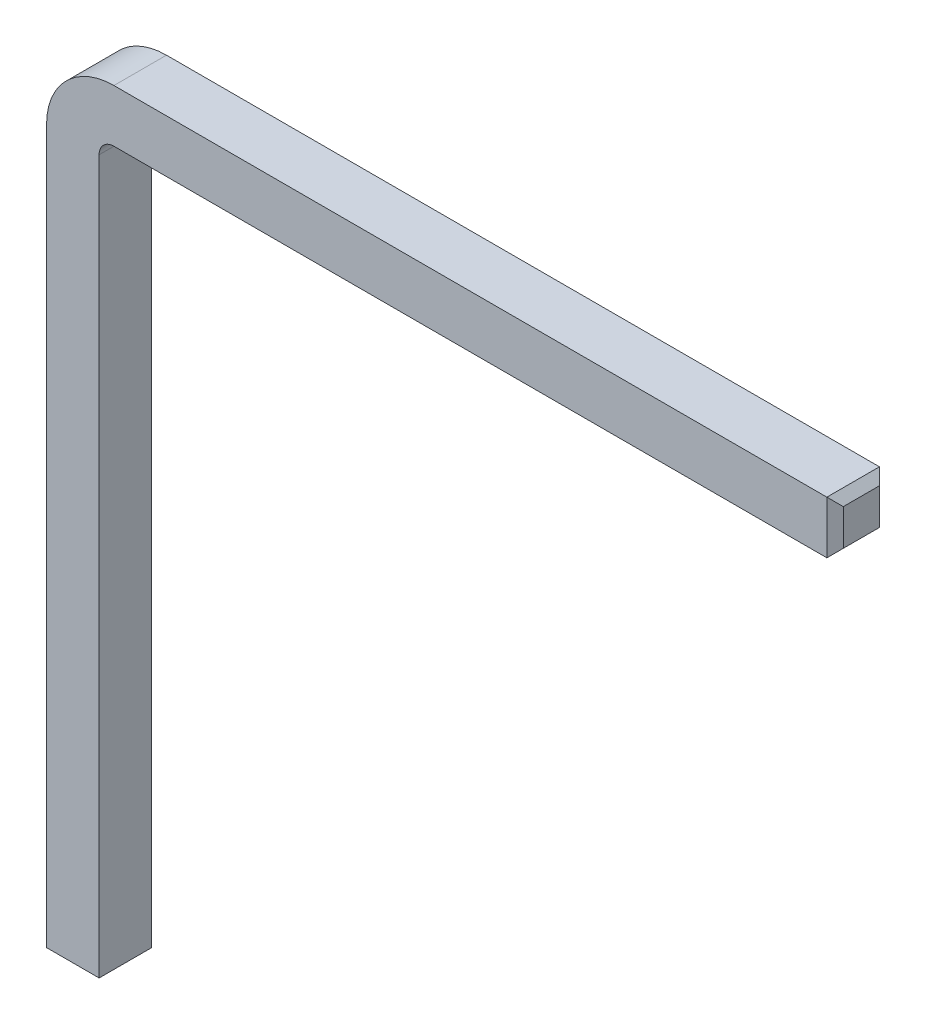
ISO-10303-21;
HEADER;
FILE_DESCRIPTION(('STEP AP214'),'2;1');
FILE_NAME('part.step','',(''),(''),'','','');
FILE_SCHEMA(('AUTOMOTIVE_DESIGN { 1 0 10303 214 1 1 1 1 }'));
ENDSEC;
DATA;
#1=APPLICATION_CONTEXT('core data for automotive mechanical design processes');
#2=APPLICATION_PROTOCOL_DEFINITION('international standard','automotive_design',2000,#1);
#3=PRODUCT_CONTEXT('',#1,'mechanical');
#4=PRODUCT('Part','Part','',(#3));
#5=PRODUCT_RELATED_PRODUCT_CATEGORY('part','',(#4));
#6=PRODUCT_DEFINITION_FORMATION('','',#4);
#7=PRODUCT_DEFINITION_CONTEXT('part definition',#1,'design');
#8=PRODUCT_DEFINITION('design','',#6,#7);
#9=PRODUCT_DEFINITION_SHAPE('','',#8);
#10=(LENGTH_UNIT() NAMED_UNIT(*) SI_UNIT(.MILLI.,.METRE.));
#11=(NAMED_UNIT(*) PLANE_ANGLE_UNIT() SI_UNIT($,.RADIAN.));
#12=(NAMED_UNIT(*) SI_UNIT($,.STERADIAN.) SOLID_ANGLE_UNIT());
#13=UNCERTAINTY_MEASURE_WITH_UNIT(LENGTH_MEASURE(1.E-05),#10,'distance_accuracy_value','');
#14=(GEOMETRIC_REPRESENTATION_CONTEXT(3) GLOBAL_UNCERTAINTY_ASSIGNED_CONTEXT((#13)) GLOBAL_UNIT_ASSIGNED_CONTEXT((#10,
#11,#12)) REPRESENTATION_CONTEXT('',''));
#15=CARTESIAN_POINT('',(0.,0.,0.));
#16=DIRECTION('',(0.,0.,1.));
#17=DIRECTION('',(1.,0.,0.));
#18=AXIS2_PLACEMENT_3D('',#15,#16,#17);
#19=CARTESIAN_POINT('',(0.5,9.6,-0.32));
#20=DIRECTION('',(0.,1.,0.));
#21=DIRECTION('',(0.,0.,1.));
#22=AXIS2_PLACEMENT_3D('',#19,#20,#21);
#23=PLANE('',#22);
#24=DIRECTION('',(1.,0.,0.));
#25=VECTOR('',#24,1.);
#26=CARTESIAN_POINT('',(0.5,9.6,0.32));
#27=LINE('',#26,#25);
#28=CARTESIAN_POINT('',(0.5,9.6,0.32));
#29=VERTEX_POINT('',#28);
#30=CARTESIAN_POINT('',(9.18,9.6,0.32));
#31=VERTEX_POINT('',#30);
#32=EDGE_CURVE('E174',#29,#31,#27,.T.);
#33=ORIENTED_EDGE('',*,*,#32,.T.);
#34=DIRECTION('',(0.,0.,-1.));
#35=VECTOR('',#34,1.);
#36=CARTESIAN_POINT('',(9.18,9.6,-0.32));
#37=LINE('',#36,#35);
#38=CARTESIAN_POINT('',(9.18,9.6,-0.32));
#39=VERTEX_POINT('',#38);
#40=EDGE_CURVE('E11',#31,#39,#37,.T.);
#41=ORIENTED_EDGE('',*,*,#40,.T.);
#42=DIRECTION('',(1.,0.,0.));
#43=VECTOR('',#42,1.);
#44=CARTESIAN_POINT('',(0.5,9.6,-0.32));
#45=LINE('',#44,#43);
#46=CARTESIAN_POINT('',(0.5,9.6,-0.32));
#47=VERTEX_POINT('',#46);
#48=EDGE_CURVE('E177',#47,#39,#45,.T.);
#49=ORIENTED_EDGE('',*,*,#48,.F.);
#50=DIRECTION('',(0.,0.,1.));
#51=VECTOR('',#50,1.);
#52=CARTESIAN_POINT('',(0.5,9.6,-0.32));
#53=LINE('',#52,#51);
#54=EDGE_CURVE('E157',#47,#29,#53,.T.);
#55=ORIENTED_EDGE('',*,*,#54,.T.);
#56=EDGE_LOOP('',(#33,#41,#49,#55));
#57=FACE_BOUND('',#56,.T.);
#58=ADVANCED_FACE('F33',(#57),#23,.T.);
#59=CARTESIAN_POINT('',(0.5,8.96,-0.32));
#60=DIRECTION('',(0.,-1.,0.));
#61=DIRECTION('',(0.,0.,-1.));
#62=AXIS2_PLACEMENT_3D('',#59,#60,#61);
#63=PLANE('',#62);
#64=DIRECTION('',(1.,0.,0.));
#65=VECTOR('',#64,1.);
#66=CARTESIAN_POINT('',(0.5,8.96,-0.32));
#67=LINE('',#66,#65);
#68=CARTESIAN_POINT('',(0.5,8.96,-0.32));
#69=VERTEX_POINT('',#68);
#70=CARTESIAN_POINT('',(9.18,8.96,-0.32));
#71=VERTEX_POINT('',#70);
#72=EDGE_CURVE('E133',#69,#71,#67,.T.);
#73=ORIENTED_EDGE('',*,*,#72,.T.);
#74=DIRECTION('',(0.,0.,1.));
#75=VECTOR('',#74,1.);
#76=CARTESIAN_POINT('',(9.18,8.96,-0.32));
#77=LINE('',#76,#75);
#78=CARTESIAN_POINT('',(9.18,8.96,0.32));
#79=VERTEX_POINT('',#78);
#80=EDGE_CURVE('E42',#71,#79,#77,.T.);
#81=ORIENTED_EDGE('',*,*,#80,.T.);
#82=DIRECTION('',(1.,0.,0.));
#83=VECTOR('',#82,1.);
#84=CARTESIAN_POINT('',(0.5,8.96,0.32));
#85=LINE('',#84,#83);
#86=CARTESIAN_POINT('',(0.5,8.96,0.32));
#87=VERTEX_POINT('',#86);
#88=EDGE_CURVE('E137',#87,#79,#85,.T.);
#89=ORIENTED_EDGE('',*,*,#88,.F.);
#90=DIRECTION('',(0.,0.,-1.));
#91=VECTOR('',#90,1.);
#92=CARTESIAN_POINT('',(0.5,8.96,-0.32));
#93=LINE('',#92,#91);
#94=EDGE_CURVE('E154',#87,#69,#93,.T.);
#95=ORIENTED_EDGE('',*,*,#94,.T.);
#96=EDGE_LOOP('',(#73,#81,#89,#95));
#97=FACE_BOUND('',#96,.T.);
#98=ADVANCED_FACE('F248',(#97),#63,.T.);
#99=CARTESIAN_POINT('',(0.5,8.78,0.));
#100=DIRECTION('',(0.,0.,-1.));
#101=DIRECTION('',(-1.,0.,0.));
#102=AXIS2_PLACEMENT_3D('',#99,#100,#101);
#103=CYLINDRICAL_SURFACE('',#102,0.819999999999999);
#104=DIRECTION('',(0.,0.,1.));
#105=VECTOR('',#104,1.);
#106=CARTESIAN_POINT('',(-0.319999999999999,8.78,-0.32));
#107=LINE('',#106,#105);
#108=CARTESIAN_POINT('',(-0.319999999999999,8.78,-0.32));
#109=VERTEX_POINT('',#108);
#110=CARTESIAN_POINT('',(-0.319999999999999,8.78,0.32));
#111=VERTEX_POINT('',#110);
#112=EDGE_CURVE('E148',#109,#111,#107,.T.);
#113=ORIENTED_EDGE('',*,*,#112,.T.);
#114=CARTESIAN_POINT('',(0.5,8.78,0.32));
#115=DIRECTION('',(0.,0.,-1.));
#116=DIRECTION('',(-1.,0.,0.));
#117=AXIS2_PLACEMENT_3D('',#114,#115,#116);
#118=CIRCLE('',#117,0.819999999999999);
#119=EDGE_CURVE('E167',#111,#29,#118,.T.);
#120=ORIENTED_EDGE('',*,*,#119,.T.);
#121=ORIENTED_EDGE('',*,*,#54,.F.);
#122=CARTESIAN_POINT('',(0.5,8.78,-0.32));
#123=DIRECTION('',(0.,0.,-1.));
#124=DIRECTION('',(-1.,0.,0.));
#125=AXIS2_PLACEMENT_3D('',#122,#123,#124);
#126=CIRCLE('',#125,0.819999999999999);
#127=EDGE_CURVE('E138',#109,#47,#126,.T.);
#128=ORIENTED_EDGE('',*,*,#127,.F.);
#129=EDGE_LOOP('',(#113,#120,#121,#128));
#130=FACE_BOUND('',#129,.T.);
#131=ADVANCED_FACE('F241',(#130),#103,.T.);
#132=CARTESIAN_POINT('',(0.5,8.78,0.));
#133=DIRECTION('',(0.,0.,-1.));
#134=DIRECTION('',(-1.,0.,0.));
#135=AXIS2_PLACEMENT_3D('',#132,#133,#134);
#136=CYLINDRICAL_SURFACE('',#135,0.179999999999999);
#137=DIRECTION('',(0.,0.,-1.));
#138=VECTOR('',#137,1.);
#139=CARTESIAN_POINT('',(0.320000000000001,8.78,-0.32));
#140=LINE('',#139,#138);
#141=CARTESIAN_POINT('',(0.320000000000001,8.78,0.32));
#142=VERTEX_POINT('',#141);
#143=CARTESIAN_POINT('',(0.320000000000001,8.78,-0.32));
#144=VERTEX_POINT('',#143);
#145=EDGE_CURVE('E141',#142,#144,#140,.T.);
#146=ORIENTED_EDGE('',*,*,#145,.T.);
#147=CARTESIAN_POINT('',(0.5,8.78,-0.32));
#148=DIRECTION('',(0.,0.,-1.));
#149=DIRECTION('',(-1.,0.,0.));
#150=AXIS2_PLACEMENT_3D('',#147,#148,#149);
#151=CIRCLE('',#150,0.179999999999999);
#152=EDGE_CURVE('E125',#144,#69,#151,.T.);
#153=ORIENTED_EDGE('',*,*,#152,.T.);
#154=ORIENTED_EDGE('',*,*,#94,.F.);
#155=CARTESIAN_POINT('',(0.5,8.78,0.32));
#156=DIRECTION('',(0.,0.,-1.));
#157=DIRECTION('',(-1.,0.,0.));
#158=AXIS2_PLACEMENT_3D('',#155,#156,#157);
#159=CIRCLE('',#158,0.179999999999999);
#160=EDGE_CURVE('E144',#142,#87,#159,.T.);
#161=ORIENTED_EDGE('',*,*,#160,.F.);
#162=EDGE_LOOP('',(#146,#153,#154,#161));
#163=FACE_BOUND('',#162,.T.);
#164=ADVANCED_FACE('F142',(#163),#136,.F.);
#165=CARTESIAN_POINT('',(0.320000000000001,8.78,-0.32));
#166=DIRECTION('',(-1.,0.,0.));
#167=DIRECTION('',(0.,0.,1.));
#168=AXIS2_PLACEMENT_3D('',#165,#166,#167);
#169=PLANE('',#168);
#170=DIRECTION('',(0.,-1.,0.));
#171=VECTOR('',#170,1.);
#172=CARTESIAN_POINT('',(0.320000000000001,8.78,0.32));
#173=LINE('',#172,#171);
#174=CARTESIAN_POINT('',(0.320000000000001,0.0999999999999994,0.32));
#175=VERTEX_POINT('',#174);
#176=EDGE_CURVE('E393',#142,#175,#173,.T.);
#177=ORIENTED_EDGE('',*,*,#176,.T.);
#178=DIRECTION('',(0.,0.,-1.));
#179=VECTOR('',#178,1.);
#180=CARTESIAN_POINT('',(0.320000000000001,0.0999999999999994,-0.32));
#181=LINE('',#180,#179);
#182=CARTESIAN_POINT('',(0.320000000000001,0.0999999999999994,-0.32));
#183=VERTEX_POINT('',#182);
#184=EDGE_CURVE('E153',#175,#183,#181,.T.);
#185=ORIENTED_EDGE('',*,*,#184,.T.);
#186=DIRECTION('',(0.,-1.,0.));
#187=VECTOR('',#186,1.);
#188=CARTESIAN_POINT('',(0.320000000000001,8.78,-0.32));
#189=LINE('',#188,#187);
#190=EDGE_CURVE('E130',#144,#183,#189,.T.);
#191=ORIENTED_EDGE('',*,*,#190,.F.);
#192=ORIENTED_EDGE('',*,*,#145,.F.);
#193=EDGE_LOOP('',(#177,#185,#191,#192));
#194=FACE_BOUND('',#193,.T.);
#195=ADVANCED_FACE('F151',(#194),#169,.F.);
#196=CARTESIAN_POINT('',(-0.319999999999999,8.78,-0.32));
#197=DIRECTION('',(0.,0.,1.));
#198=DIRECTION('',(1.,0.,0.));
#199=AXIS2_PLACEMENT_3D('',#196,#197,#198);
#200=PLANE('',#199);
#201=ORIENTED_EDGE('',*,*,#190,.T.);
#202=DIRECTION('',(-1.,0.,0.));
#203=VECTOR('',#202,1.);
#204=CARTESIAN_POINT('',(-0.319999999999999,0.0999999999999994,-0.32));
#205=LINE('',#204,#203);
#206=CARTESIAN_POINT('',(-0.319999999999999,0.0999999999999994,-0.32));
#207=VERTEX_POINT('',#206);
#208=EDGE_CURVE('E183',#183,#207,#205,.T.);
#209=ORIENTED_EDGE('',*,*,#208,.T.);
#210=DIRECTION('',(0.,-1.,0.));
#211=VECTOR('',#210,1.);
#212=CARTESIAN_POINT('',(-0.319999999999999,8.78,-0.32));
#213=LINE('',#212,#211);
#214=EDGE_CURVE('E155',#109,#207,#213,.T.);
#215=ORIENTED_EDGE('',*,*,#214,.F.);
#216=ORIENTED_EDGE('',*,*,#127,.T.);
#217=ORIENTED_EDGE('',*,*,#48,.T.);
#218=DIRECTION('',(0.,-1.,0.));
#219=VECTOR('',#218,1.);
#220=CARTESIAN_POINT('',(9.18,8.96,-0.32));
#221=LINE('',#220,#219);
#222=EDGE_CURVE('E181',#39,#71,#221,.T.);
#223=ORIENTED_EDGE('',*,*,#222,.T.);
#224=ORIENTED_EDGE('',*,*,#72,.F.);
#225=ORIENTED_EDGE('',*,*,#152,.F.);
#226=EDGE_LOOP('',(#201,#209,#215,#216,#217,#223,#224,#225));
#227=FACE_BOUND('',#226,.T.);
#228=ADVANCED_FACE('F127',(#227),#200,.F.);
#229=CARTESIAN_POINT('',(-0.319999999999999,8.78,-0.32));
#230=DIRECTION('',(1.,0.,0.));
#231=DIRECTION('',(0.,0.,-1.));
#232=AXIS2_PLACEMENT_3D('',#229,#230,#231);
#233=PLANE('',#232);
#234=ORIENTED_EDGE('',*,*,#214,.T.);
#235=DIRECTION('',(0.,0.,1.));
#236=VECTOR('',#235,1.);
#237=CARTESIAN_POINT('',(-0.319999999999999,0.0999999999999994,-0.32));
#238=LINE('',#237,#236);
#239=CARTESIAN_POINT('',(-0.319999999999999,0.0999999999999994,0.32));
#240=VERTEX_POINT('',#239);
#241=EDGE_CURVE('E194',#207,#240,#238,.T.);
#242=ORIENTED_EDGE('',*,*,#241,.T.);
#243=DIRECTION('',(0.,-1.,0.));
#244=VECTOR('',#243,1.);
#245=CARTESIAN_POINT('',(-0.319999999999999,8.78,0.32));
#246=LINE('',#245,#244);
#247=EDGE_CURVE('E160',#111,#240,#246,.T.);
#248=ORIENTED_EDGE('',*,*,#247,.F.);
#249=ORIENTED_EDGE('',*,*,#112,.F.);
#250=EDGE_LOOP('',(#234,#242,#248,#249));
#251=FACE_BOUND('',#250,.T.);
#252=ADVANCED_FACE('F262',(#251),#233,.F.);
#253=CARTESIAN_POINT('',(-0.319999999999999,8.78,0.32));
#254=DIRECTION('',(0.,0.,-1.));
#255=DIRECTION('',(-1.,0.,0.));
#256=AXIS2_PLACEMENT_3D('',#253,#254,#255);
#257=PLANE('',#256);
#258=ORIENTED_EDGE('',*,*,#247,.T.);
#259=DIRECTION('',(1.,0.,0.));
#260=VECTOR('',#259,1.);
#261=CARTESIAN_POINT('',(-0.319999999999999,0.0999999999999994,0.32));
#262=LINE('',#261,#260);
#263=EDGE_CURVE('E198',#240,#175,#262,.T.);
#264=ORIENTED_EDGE('',*,*,#263,.T.);
#265=ORIENTED_EDGE('',*,*,#176,.F.);
#266=ORIENTED_EDGE('',*,*,#160,.T.);
#267=ORIENTED_EDGE('',*,*,#88,.T.);
#268=DIRECTION('',(0.,1.,0.));
#269=VECTOR('',#268,1.);
#270=CARTESIAN_POINT('',(9.18,9.6,0.32));
#271=LINE('',#270,#269);
#272=EDGE_CURVE('E196',#79,#31,#271,.T.);
#273=ORIENTED_EDGE('',*,*,#272,.T.);
#274=ORIENTED_EDGE('',*,*,#32,.F.);
#275=ORIENTED_EDGE('',*,*,#119,.F.);
#276=EDGE_LOOP('',(#258,#264,#265,#266,#267,#273,#274,#275));
#277=FACE_BOUND('',#276,.T.);
#278=ADVANCED_FACE('F245',(#277),#257,.F.);
#279=CARTESIAN_POINT('',(9.28,9.28,0.));
#280=DIRECTION('',(1.,0.,0.));
#281=DIRECTION('',(0.,0.,1.));
#282=AXIS2_PLACEMENT_3D('',#279,#280,#281);
#283=PLANE('',#282);
#284=DIRECTION('',(0.,-1.,0.));
#285=VECTOR('',#284,1.);
#286=CARTESIAN_POINT('',(9.28,8.96,0.220000000000001));
#287=LINE('',#286,#285);
#288=CARTESIAN_POINT('',(9.28,9.5,0.220000000000001));
#289=VERTEX_POINT('',#288);
#290=CARTESIAN_POINT('',(9.28,9.06,0.220000000000001));
#291=VERTEX_POINT('',#290);
#292=EDGE_CURVE('E201',#289,#291,#287,.T.);
#293=ORIENTED_EDGE('',*,*,#292,.T.);
#294=DIRECTION('',(0.,0.,-1.));
#295=VECTOR('',#294,1.);
#296=CARTESIAN_POINT('',(9.28,9.06,0.));
#297=LINE('',#296,#295);
#298=CARTESIAN_POINT('',(9.28,9.06,-0.220000000000001));
#299=VERTEX_POINT('',#298);
#300=EDGE_CURVE('E206',#291,#299,#297,.T.);
#301=ORIENTED_EDGE('',*,*,#300,.T.);
#302=DIRECTION('',(0.,1.,0.));
#303=VECTOR('',#302,1.);
#304=CARTESIAN_POINT('',(9.28,9.6,-0.220000000000001));
#305=LINE('',#304,#303);
#306=CARTESIAN_POINT('',(9.28,9.5,-0.220000000000001));
#307=VERTEX_POINT('',#306);
#308=EDGE_CURVE('E57',#299,#307,#305,.T.);
#309=ORIENTED_EDGE('',*,*,#308,.T.);
#310=DIRECTION('',(0.,0.,1.));
#311=VECTOR('',#310,1.);
#312=CARTESIAN_POINT('',(9.28,9.5,0.));
#313=LINE('',#312,#311);
#314=EDGE_CURVE('E203',#307,#289,#313,.T.);
#315=ORIENTED_EDGE('',*,*,#314,.T.);
#316=EDGE_LOOP('',(#293,#301,#309,#315));
#317=FACE_BOUND('',#316,.T.);
#318=ADVANCED_FACE('F251',(#317),#283,.T.);
#319=CARTESIAN_POINT('',(0.,0.,0.));
#320=DIRECTION('',(0.,1.,0.));
#321=DIRECTION('',(0.,0.,1.));
#322=AXIS2_PLACEMENT_3D('',#319,#320,#321);
#323=PLANE('',#322);
#324=DIRECTION('',(0.,0.,-1.));
#325=VECTOR('',#324,1.);
#326=CARTESIAN_POINT('',(-0.220000000000001,0.,0.));
#327=LINE('',#326,#325);
#328=CARTESIAN_POINT('',(-0.220000000000001,0.,0.220000000000002));
#329=VERTEX_POINT('',#328);
#330=CARTESIAN_POINT('',(-0.220000000000001,0.,-0.220000000000002));
#331=VERTEX_POINT('',#330);
#332=EDGE_CURVE('E189',#329,#331,#327,.T.);
#333=ORIENTED_EDGE('',*,*,#332,.T.);
#334=DIRECTION('',(1.,0.,0.));
#335=VECTOR('',#334,1.);
#336=CARTESIAN_POINT('',(0.,0.,-0.220000000000002));
#337=LINE('',#336,#335);
#338=CARTESIAN_POINT('',(0.220000000000003,0.,-0.220000000000002));
#339=VERTEX_POINT('',#338);
#340=EDGE_CURVE('E191',#331,#339,#337,.T.);
#341=ORIENTED_EDGE('',*,*,#340,.T.);
#342=DIRECTION('',(0.,0.,1.));
#343=VECTOR('',#342,1.);
#344=CARTESIAN_POINT('',(0.220000000000003,0.,0.));
#345=LINE('',#344,#343);
#346=CARTESIAN_POINT('',(0.220000000000003,0.,0.220000000000002));
#347=VERTEX_POINT('',#346);
#348=EDGE_CURVE('E185',#339,#347,#345,.T.);
#349=ORIENTED_EDGE('',*,*,#348,.T.);
#350=DIRECTION('',(-1.,0.,0.));
#351=VECTOR('',#350,1.);
#352=CARTESIAN_POINT('',(0.,0.,0.220000000000002));
#353=LINE('',#352,#351);
#354=EDGE_CURVE('E187',#347,#329,#353,.T.);
#355=ORIENTED_EDGE('',*,*,#354,.T.);
#356=EDGE_LOOP('',(#333,#341,#349,#355));
#357=FACE_BOUND('',#356,.T.);
#358=ADVANCED_FACE('F253',(#357),#323,.F.);
#359=CARTESIAN_POINT('',(-0.319999999999999,0.0999999999999994,0.32));
#360=DIRECTION('',(0.,0.707106781186541,-0.707106781186554));
#361=DIRECTION('',(1.,0.,0.));
#362=AXIS2_PLACEMENT_3D('',#359,#360,#361);
#363=PLANE('',#362);
#364=DIRECTION('',(0.577350269189622,-0.577350269189632,-0.577350269189622));
#365=VECTOR('',#364,1.);
#366=CARTESIAN_POINT('',(-0.319999999999999,0.0999999999999994,0.32));
#367=LINE('',#366,#365);
#368=EDGE_CURVE('E214',#329,#240,#367,.F.);
#369=ORIENTED_EDGE('',*,*,#368,.F.);
#370=ORIENTED_EDGE('',*,*,#354,.F.);
#371=DIRECTION('',(-0.577350269189622,-0.577350269189632,-0.577350269189622));
#372=VECTOR('',#371,1.);
#373=CARTESIAN_POINT('',(0.10666666666667,-0.113333333333335,0.106666666666669));
#374=LINE('',#373,#372);
#375=EDGE_CURVE('E149',#175,#347,#374,.T.);
#376=ORIENTED_EDGE('',*,*,#375,.F.);
#377=ORIENTED_EDGE('',*,*,#263,.F.);
#378=EDGE_LOOP('',(#369,#370,#376,#377));
#379=FACE_BOUND('',#378,.T.);
#380=ADVANCED_FACE('F259',(#379),#363,.F.);
#381=CARTESIAN_POINT('',(0.320000000000001,0.0999999999999994,-0.32));
#382=DIRECTION('',(-0.707106781186554,0.707106781186541,0.));
#383=DIRECTION('',(0.,0.,-1.));
#384=AXIS2_PLACEMENT_3D('',#381,#382,#383);
#385=PLANE('',#384);
#386=ORIENTED_EDGE('',*,*,#375,.T.);
#387=ORIENTED_EDGE('',*,*,#348,.F.);
#388=DIRECTION('',(0.577350269189622,0.577350269189632,-0.577350269189622));
#389=VECTOR('',#388,1.);
#390=CARTESIAN_POINT('',(0.320000000000001,0.0999999999999994,-0.32));
#391=LINE('',#390,#389);
#392=EDGE_CURVE('E212',#183,#339,#391,.F.);
#393=ORIENTED_EDGE('',*,*,#392,.F.);
#394=ORIENTED_EDGE('',*,*,#184,.F.);
#395=EDGE_LOOP('',(#386,#387,#393,#394));
#396=FACE_BOUND('',#395,.T.);
#397=ADVANCED_FACE('F279',(#396),#385,.F.);
#398=CARTESIAN_POINT('',(-0.319999999999999,0.0999999999999994,-0.32));
#399=DIRECTION('',(0.707106781186554,0.707106781186541,0.));
#400=DIRECTION('',(0.,0.,1.));
#401=AXIS2_PLACEMENT_3D('',#398,#399,#400);
#402=PLANE('',#401);
#403=ORIENTED_EDGE('',*,*,#368,.T.);
#404=ORIENTED_EDGE('',*,*,#241,.F.);
#405=DIRECTION('',(0.577350269189622,-0.577350269189632,0.577350269189622));
#406=VECTOR('',#405,1.);
#407=CARTESIAN_POINT('',(-0.319999999999999,0.0999999999999994,-0.32));
#408=LINE('',#407,#406);
#409=EDGE_CURVE('E210',#331,#207,#408,.F.);
#410=ORIENTED_EDGE('',*,*,#409,.F.);
#411=ORIENTED_EDGE('',*,*,#332,.F.);
#412=EDGE_LOOP('',(#403,#404,#410,#411));
#413=FACE_BOUND('',#412,.T.);
#414=ADVANCED_FACE('F275',(#413),#402,.F.);
#415=CARTESIAN_POINT('',(-0.319999999999999,0.0999999999999994,-0.32));
#416=DIRECTION('',(0.,0.707106781186541,0.707106781186554));
#417=DIRECTION('',(-1.,0.,0.));
#418=AXIS2_PLACEMENT_3D('',#415,#416,#417);
#419=PLANE('',#418);
#420=ORIENTED_EDGE('',*,*,#392,.T.);
#421=ORIENTED_EDGE('',*,*,#340,.F.);
#422=ORIENTED_EDGE('',*,*,#409,.T.);
#423=ORIENTED_EDGE('',*,*,#208,.F.);
#424=EDGE_LOOP('',(#420,#421,#422,#423));
#425=FACE_BOUND('',#424,.T.);
#426=ADVANCED_FACE('F272',(#425),#419,.F.);
#427=CARTESIAN_POINT('',(9.28,9.5,0.));
#428=DIRECTION('',(-0.707106781186548,-0.707106781186548,0.));
#429=DIRECTION('',(0.,0.,1.));
#430=AXIS2_PLACEMENT_3D('',#427,#428,#429);
#431=PLANE('',#430);
#432=DIRECTION('',(0.577350269189626,-0.577350269189626,0.577350269189626));
#433=VECTOR('',#432,1.);
#434=CARTESIAN_POINT('',(9.35333333333333,9.42666666666666,-0.146666666666667));
#435=LINE('',#434,#433);
#436=EDGE_CURVE('E221',#39,#307,#435,.T.);
#437=ORIENTED_EDGE('',*,*,#436,.F.);
#438=ORIENTED_EDGE('',*,*,#40,.F.);
#439=DIRECTION('',(0.577350269189626,-0.577350269189626,-0.577350269189626));
#440=VECTOR('',#439,1.);
#441=CARTESIAN_POINT('',(9.35333333333333,9.42666666666666,0.146666666666667));
#442=LINE('',#441,#440);
#443=EDGE_CURVE('E37',#289,#31,#442,.F.);
#444=ORIENTED_EDGE('',*,*,#443,.F.);
#445=ORIENTED_EDGE('',*,*,#314,.F.);
#446=EDGE_LOOP('',(#437,#438,#444,#445));
#447=FACE_BOUND('',#446,.T.);
#448=ADVANCED_FACE('F35',(#447),#431,.F.);
#449=CARTESIAN_POINT('',(9.28,9.28,0.220000000000001));
#450=DIRECTION('',(0.707106781186547,0.,0.707106781186548));
#451=DIRECTION('',(0.,1.,0.));
#452=AXIS2_PLACEMENT_3D('',#449,#450,#451);
#453=PLANE('',#452);
#454=ORIENTED_EDGE('',*,*,#443,.T.);
#455=ORIENTED_EDGE('',*,*,#272,.F.);
#456=DIRECTION('',(-0.577350269189626,-0.577350269189626,0.577350269189626));
#457=VECTOR('',#456,1.);
#458=CARTESIAN_POINT('',(9.35333333333333,9.13333333333333,0.146666666666667));
#459=LINE('',#458,#457);
#460=EDGE_CURVE('E220',#291,#79,#459,.T.);
#461=ORIENTED_EDGE('',*,*,#460,.F.);
#462=ORIENTED_EDGE('',*,*,#292,.F.);
#463=EDGE_LOOP('',(#454,#455,#461,#462));
#464=FACE_BOUND('',#463,.T.);
#465=ADVANCED_FACE('F231',(#464),#453,.T.);
#466=CARTESIAN_POINT('',(9.28,9.28,-0.220000000000001));
#467=DIRECTION('',(0.707106781186547,0.,-0.707106781186548));
#468=DIRECTION('',(0.,-1.,0.));
#469=AXIS2_PLACEMENT_3D('',#466,#467,#468);
#470=PLANE('',#469);
#471=ORIENTED_EDGE('',*,*,#436,.T.);
#472=ORIENTED_EDGE('',*,*,#308,.F.);
#473=DIRECTION('',(0.577350269189626,0.577350269189626,0.577350269189626));
#474=VECTOR('',#473,1.);
#475=CARTESIAN_POINT('',(9.35333333333333,9.13333333333333,-0.146666666666667));
#476=LINE('',#475,#474);
#477=EDGE_CURVE('E50',#71,#299,#476,.T.);
#478=ORIENTED_EDGE('',*,*,#477,.F.);
#479=ORIENTED_EDGE('',*,*,#222,.F.);
#480=EDGE_LOOP('',(#471,#472,#478,#479));
#481=FACE_BOUND('',#480,.T.);
#482=ADVANCED_FACE('F250',(#481),#470,.T.);
#483=CARTESIAN_POINT('',(9.28,9.06,0.));
#484=DIRECTION('',(-0.707106781186548,0.707106781186548,0.));
#485=DIRECTION('',(0.,0.,-1.));
#486=AXIS2_PLACEMENT_3D('',#483,#484,#485);
#487=PLANE('',#486);
#488=ORIENTED_EDGE('',*,*,#460,.T.);
#489=ORIENTED_EDGE('',*,*,#80,.F.);
#490=ORIENTED_EDGE('',*,*,#477,.T.);
#491=ORIENTED_EDGE('',*,*,#300,.F.);
#492=EDGE_LOOP('',(#488,#489,#490,#491));
#493=FACE_BOUND('',#492,.T.);
#494=ADVANCED_FACE('F249',(#493),#487,.F.);
#495=CLOSED_SHELL('',(#58,#98,#131,#164,#195,#228,#252,#278,#318,#358,#380,#397,#414,#426,#448,
#465,#482,#494));
#496=MANIFOLD_SOLID_BREP('B2',#495);
#497=ADVANCED_BREP_SHAPE_REPRESENTATION('',(#18,#496),#14);
#498=SHAPE_DEFINITION_REPRESENTATION(#9,#497);
ENDSEC;
END-ISO-10303-21;
